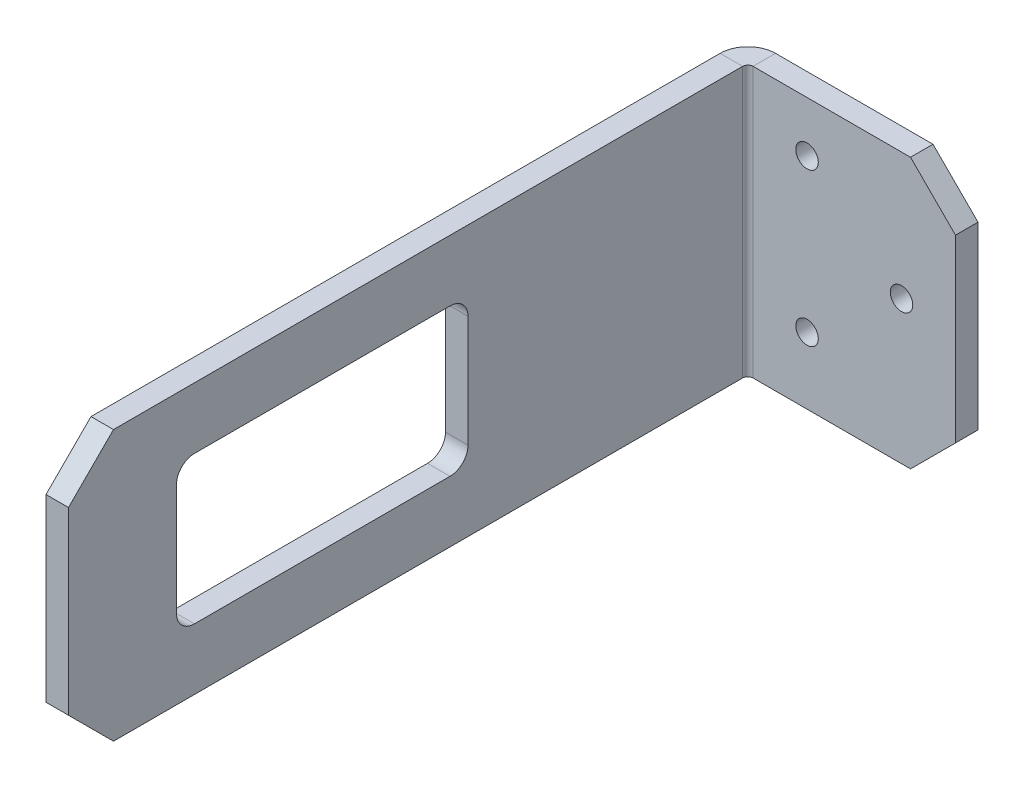
ISO-10303-21;
HEADER;
FILE_DESCRIPTION(('STEP AP214'),'2;1');
FILE_NAME('part.step','',(''),(''),'','','');
FILE_SCHEMA(('AUTOMOTIVE_DESIGN { 1 0 10303 214 1 1 1 1 }'));
ENDSEC;
DATA;
#1=APPLICATION_CONTEXT('core data for automotive mechanical design processes');
#2=APPLICATION_PROTOCOL_DEFINITION('international standard','automotive_design',2000,#1);
#3=PRODUCT_CONTEXT('',#1,'mechanical');
#4=PRODUCT('Part','Part','',(#3));
#5=PRODUCT_RELATED_PRODUCT_CATEGORY('part','',(#4));
#6=PRODUCT_DEFINITION_FORMATION('','',#4);
#7=PRODUCT_DEFINITION_CONTEXT('part definition',#1,'design');
#8=PRODUCT_DEFINITION('design','',#6,#7);
#9=PRODUCT_DEFINITION_SHAPE('','',#8);
#10=(LENGTH_UNIT() NAMED_UNIT(*) SI_UNIT(.MILLI.,.METRE.));
#11=(NAMED_UNIT(*) PLANE_ANGLE_UNIT() SI_UNIT($,.RADIAN.));
#12=(NAMED_UNIT(*) SI_UNIT($,.STERADIAN.) SOLID_ANGLE_UNIT());
#13=UNCERTAINTY_MEASURE_WITH_UNIT(LENGTH_MEASURE(1.E-05),#10,'distance_accuracy_value','');
#14=(GEOMETRIC_REPRESENTATION_CONTEXT(3) GLOBAL_UNCERTAINTY_ASSIGNED_CONTEXT((#13)) GLOBAL_UNIT_ASSIGNED_CONTEXT((#10,
#11,#12)) REPRESENTATION_CONTEXT('',''));
#15=CARTESIAN_POINT('',(0.,0.,0.));
#16=DIRECTION('',(0.,0.,1.));
#17=DIRECTION('',(1.,0.,0.));
#18=AXIS2_PLACEMENT_3D('',#15,#16,#17);
#19=CARTESIAN_POINT('',(0.,38.1,-3.175));
#20=DIRECTION('',(0.,1.,0.));
#21=DIRECTION('',(0.,0.,1.));
#22=AXIS2_PLACEMENT_3D('',#19,#20,#21);
#23=PLANE('',#22);
#24=DIRECTION('',(-1.,0.,0.));
#25=VECTOR('',#24,1.);
#26=CARTESIAN_POINT('',(0.,38.1,0.));
#27=LINE('',#26,#25);
#28=CARTESIAN_POINT('',(22.225,38.1,0.));
#29=VERTEX_POINT('',#28);
#30=CARTESIAN_POINT('',(0.,38.1,0.));
#31=VERTEX_POINT('',#30);
#32=EDGE_CURVE('E293',#29,#31,#27,.T.);
#33=ORIENTED_EDGE('',*,*,#32,.F.);
#34=DIRECTION('',(0.,0.,-1.));
#35=VECTOR('',#34,1.);
#36=CARTESIAN_POINT('',(22.225,38.1,-3.175));
#37=LINE('',#36,#35);
#38=CARTESIAN_POINT('',(22.225,38.1,-3.175));
#39=VERTEX_POINT('',#38);
#40=EDGE_CURVE('E319',#29,#39,#37,.T.);
#41=ORIENTED_EDGE('',*,*,#40,.T.);
#42=DIRECTION('',(-1.,0.,0.));
#43=VECTOR('',#42,1.);
#44=CARTESIAN_POINT('',(0.,38.1,-3.175));
#45=LINE('',#44,#43);
#46=CARTESIAN_POINT('',(0.,38.1,-3.175));
#47=VERTEX_POINT('',#46);
#48=EDGE_CURVE('E298',#39,#47,#45,.T.);
#49=ORIENTED_EDGE('',*,*,#48,.T.);
#50=DIRECTION('',(0.,0.,1.));
#51=VECTOR('',#50,1.);
#52=CARTESIAN_POINT('',(0.,38.1,-3.175));
#53=LINE('',#52,#51);
#54=EDGE_CURVE('E309',#47,#31,#53,.T.);
#55=ORIENTED_EDGE('',*,*,#54,.T.);
#56=EDGE_LOOP('',(#33,#41,#49,#55));
#57=FACE_BOUND('',#56,.T.);
#58=ADVANCED_FACE('F59',(#57),#23,.T.);
#59=CARTESIAN_POINT('',(28.575,0.,-3.175));
#60=DIRECTION('',(1.,0.,0.));
#61=DIRECTION('',(0.,0.,-1.));
#62=AXIS2_PLACEMENT_3D('',#59,#60,#61);
#63=PLANE('',#62);
#64=DIRECTION('',(0.,1.,0.));
#65=VECTOR('',#64,1.);
#66=CARTESIAN_POINT('',(28.575,0.,0.));
#67=LINE('',#66,#65);
#68=CARTESIAN_POINT('',(28.575,6.35000000000004,0.));
#69=VERTEX_POINT('',#68);
#70=CARTESIAN_POINT('',(28.575,31.7499999999999,0.));
#71=VERTEX_POINT('',#70);
#72=EDGE_CURVE('E306',#69,#71,#67,.T.);
#73=ORIENTED_EDGE('',*,*,#72,.F.);
#74=DIRECTION('',(0.,0.,-1.));
#75=VECTOR('',#74,1.);
#76=CARTESIAN_POINT('',(28.575,6.35000000000004,-3.175));
#77=LINE('',#76,#75);
#78=CARTESIAN_POINT('',(28.575,6.35000000000004,-3.175));
#79=VERTEX_POINT('',#78);
#80=EDGE_CURVE('E329',#69,#79,#77,.T.);
#81=ORIENTED_EDGE('',*,*,#80,.T.);
#82=DIRECTION('',(0.,1.,0.));
#83=VECTOR('',#82,1.);
#84=CARTESIAN_POINT('',(28.575,0.,-3.175));
#85=LINE('',#84,#83);
#86=CARTESIAN_POINT('',(28.575,31.7499999999999,-3.175));
#87=VERTEX_POINT('',#86);
#88=EDGE_CURVE('E296',#79,#87,#85,.T.);
#89=ORIENTED_EDGE('',*,*,#88,.T.);
#90=DIRECTION('',(0.,0.,1.));
#91=VECTOR('',#90,1.);
#92=CARTESIAN_POINT('',(28.575,31.75,-3.175));
#93=LINE('',#92,#91);
#94=EDGE_CURVE('E312',#87,#71,#93,.T.);
#95=ORIENTED_EDGE('',*,*,#94,.T.);
#96=EDGE_LOOP('',(#73,#81,#89,#95));
#97=FACE_BOUND('',#96,.T.);
#98=ADVANCED_FACE('F413',(#97),#63,.T.);
#99=CARTESIAN_POINT('',(0.,0.,-3.175));
#100=DIRECTION('',(0.,-1.,0.));
#101=DIRECTION('',(0.,0.,-1.));
#102=AXIS2_PLACEMENT_3D('',#99,#100,#101);
#103=PLANE('',#102);
#104=DIRECTION('',(1.,0.,0.));
#105=VECTOR('',#104,1.);
#106=CARTESIAN_POINT('',(0.,0.,-3.175));
#107=LINE('',#106,#105);
#108=CARTESIAN_POINT('',(0.,0.,-3.175));
#109=VERTEX_POINT('',#108);
#110=CARTESIAN_POINT('',(22.225,0.,-3.175));
#111=VERTEX_POINT('',#110);
#112=EDGE_CURVE('E292',#109,#111,#107,.T.);
#113=ORIENTED_EDGE('',*,*,#112,.T.);
#114=DIRECTION('',(0.,0.,1.));
#115=VECTOR('',#114,1.);
#116=CARTESIAN_POINT('',(22.225,0.,-3.175));
#117=LINE('',#116,#115);
#118=CARTESIAN_POINT('',(22.225,0.,0.));
#119=VERTEX_POINT('',#118);
#120=EDGE_CURVE('E324',#111,#119,#117,.T.);
#121=ORIENTED_EDGE('',*,*,#120,.T.);
#122=DIRECTION('',(1.,0.,0.));
#123=VECTOR('',#122,1.);
#124=CARTESIAN_POINT('',(0.,0.,0.));
#125=LINE('',#124,#123);
#126=CARTESIAN_POINT('',(0.,0.,0.));
#127=VERTEX_POINT('',#126);
#128=EDGE_CURVE('E303',#127,#119,#125,.T.);
#129=ORIENTED_EDGE('',*,*,#128,.F.);
#130=DIRECTION('',(0.,0.,1.));
#131=VECTOR('',#130,1.);
#132=CARTESIAN_POINT('',(0.,0.,-3.175));
#133=LINE('',#132,#131);
#134=EDGE_CURVE('E300',#109,#127,#133,.T.);
#135=ORIENTED_EDGE('',*,*,#134,.F.);
#136=EDGE_LOOP('',(#113,#121,#129,#135));
#137=FACE_BOUND('',#136,.T.);
#138=ADVANCED_FACE('F391',(#137),#103,.T.);
#139=CARTESIAN_POINT('',(0.,0.,-3.175));
#140=DIRECTION('',(0.,0.,-1.));
#141=DIRECTION('',(-1.,0.,0.));
#142=AXIS2_PLACEMENT_3D('',#139,#140,#141);
#143=PLANE('',#142);
#144=CARTESIAN_POINT('',(7.62,30.962643990037,-3.175));
#145=DIRECTION('',(0.,0.,-1.));
#146=DIRECTION('',(-1.,0.,0.));
#147=AXIS2_PLACEMENT_3D('',#144,#145,#146);
#148=CIRCLE('',#147,1.5875);
#149=CARTESIAN_POINT('',(6.0325,30.962643990037,-3.175));
#150=VERTEX_POINT('',#149);
#151=EDGE_CURVE('E778',#150,#150,#148,.F.);
#152=ORIENTED_EDGE('',*,*,#151,.T.);
#153=EDGE_LOOP('',(#152));
#154=FACE_BOUND('',#153,.T.);
#155=CARTESIAN_POINT('',(20.955,20.1838638437053,-3.175));
#156=DIRECTION('',(0.,0.,-1.));
#157=DIRECTION('',(-1.,0.,0.));
#158=AXIS2_PLACEMENT_3D('',#155,#156,#157);
#159=CIRCLE('',#158,1.5875);
#160=CARTESIAN_POINT('',(19.3675,20.1838638437053,-3.175));
#161=VERTEX_POINT('',#160);
#162=EDGE_CURVE('E491',#161,#161,#159,.F.);
#163=ORIENTED_EDGE('',*,*,#162,.T.);
#164=EDGE_LOOP('',(#163));
#165=FACE_BOUND('',#164,.T.);
#166=CARTESIAN_POINT('',(7.62,9.40508369737358,-3.175));
#167=DIRECTION('',(0.,0.,-1.));
#168=DIRECTION('',(-1.,0.,0.));
#169=AXIS2_PLACEMENT_3D('',#166,#167,#168);
#170=CIRCLE('',#169,1.5875);
#171=CARTESIAN_POINT('',(6.0325,9.40508369737358,-3.175));
#172=VERTEX_POINT('',#171);
#173=EDGE_CURVE('E492',#172,#172,#170,.F.);
#174=ORIENTED_EDGE('',*,*,#173,.T.);
#175=EDGE_LOOP('',(#174));
#176=FACE_BOUND('',#175,.T.);
#177=ORIENTED_EDGE('',*,*,#88,.F.);
#178=DIRECTION('',(0.707106781186548,0.707106781186547,0.));
#179=VECTOR('',#178,1.);
#180=CARTESIAN_POINT('',(11.1125,-11.1125,-3.175));
#181=LINE('',#180,#179);
#182=EDGE_CURVE('E331',#79,#111,#181,.F.);
#183=ORIENTED_EDGE('',*,*,#182,.T.);
#184=ORIENTED_EDGE('',*,*,#112,.F.);
#185=DIRECTION('',(0.,-1.,0.));
#186=VECTOR('',#185,1.);
#187=CARTESIAN_POINT('',(0.,0.,-3.175));
#188=LINE('',#187,#186);
#189=EDGE_CURVE('E289',#47,#109,#188,.T.);
#190=ORIENTED_EDGE('',*,*,#189,.F.);
#191=ORIENTED_EDGE('',*,*,#48,.F.);
#192=DIRECTION('',(-0.707106781186548,0.707106781186547,0.));
#193=VECTOR('',#192,1.);
#194=CARTESIAN_POINT('',(30.1625,30.1625,-3.175));
#195=LINE('',#194,#193);
#196=EDGE_CURVE('E321',#39,#87,#195,.F.);
#197=ORIENTED_EDGE('',*,*,#196,.T.);
#198=EDGE_LOOP('',(#177,#183,#184,#190,#191,#197));
#199=FACE_BOUND('',#198,.T.);
#200=ADVANCED_FACE('F399',(#154,#165,#176,#199),#143,.T.);
#201=CARTESIAN_POINT('',(0.,0.,0.));
#202=DIRECTION('',(0.,0.,-1.));
#203=DIRECTION('',(-1.,0.,0.));
#204=AXIS2_PLACEMENT_3D('',#201,#202,#203);
#205=PLANE('',#204);
#206=CARTESIAN_POINT('',(7.62,30.962643990037,0.));
#207=DIRECTION('',(0.,0.,1.));
#208=DIRECTION('',(1.,0.,0.));
#209=AXIS2_PLACEMENT_3D('',#206,#207,#208);
#210=CIRCLE('',#209,1.5875);
#211=CARTESIAN_POINT('',(9.2075,30.962643990037,0.));
#212=VERTEX_POINT('',#211);
#213=EDGE_CURVE('E482',#212,#212,#210,.T.);
#214=ORIENTED_EDGE('',*,*,#213,.F.);
#215=EDGE_LOOP('',(#214));
#216=FACE_BOUND('',#215,.T.);
#217=CARTESIAN_POINT('',(20.955,20.1838638437053,0.));
#218=DIRECTION('',(0.,0.,1.));
#219=DIRECTION('',(1.,0.,0.));
#220=AXIS2_PLACEMENT_3D('',#217,#218,#219);
#221=CIRCLE('',#220,1.5875);
#222=CARTESIAN_POINT('',(22.5425,20.1838638437053,0.));
#223=VERTEX_POINT('',#222);
#224=EDGE_CURVE('E486',#223,#223,#221,.T.);
#225=ORIENTED_EDGE('',*,*,#224,.F.);
#226=EDGE_LOOP('',(#225));
#227=FACE_BOUND('',#226,.T.);
#228=CARTESIAN_POINT('',(7.62,9.40508369737358,0.));
#229=DIRECTION('',(0.,0.,1.));
#230=DIRECTION('',(1.,0.,0.));
#231=AXIS2_PLACEMENT_3D('',#228,#229,#230);
#232=CIRCLE('',#231,1.5875);
#233=CARTESIAN_POINT('',(9.2075,9.40508369737358,0.));
#234=VERTEX_POINT('',#233);
#235=EDGE_CURVE('E489',#234,#234,#232,.T.);
#236=ORIENTED_EDGE('',*,*,#235,.F.);
#237=EDGE_LOOP('',(#236));
#238=FACE_BOUND('',#237,.T.);
#239=ORIENTED_EDGE('',*,*,#128,.T.);
#240=DIRECTION('',(-0.707106781186548,-0.707106781186547,0.));
#241=VECTOR('',#240,1.);
#242=CARTESIAN_POINT('',(22.225,0.,0.));
#243=LINE('',#242,#241);
#244=EDGE_CURVE('E327',#119,#69,#243,.F.);
#245=ORIENTED_EDGE('',*,*,#244,.T.);
#246=ORIENTED_EDGE('',*,*,#72,.T.);
#247=DIRECTION('',(0.707106781186548,-0.707106781186547,0.));
#248=VECTOR('',#247,1.);
#249=CARTESIAN_POINT('',(28.575,31.75,0.));
#250=LINE('',#249,#248);
#251=EDGE_CURVE('E317',#71,#29,#250,.F.);
#252=ORIENTED_EDGE('',*,*,#251,.T.);
#253=ORIENTED_EDGE('',*,*,#32,.T.);
#254=DIRECTION('',(0.,-1.,0.));
#255=VECTOR('',#254,1.);
#256=CARTESIAN_POINT('',(0.,0.,0.));
#257=LINE('',#256,#255);
#258=EDGE_CURVE('E280',#31,#127,#257,.T.);
#259=ORIENTED_EDGE('',*,*,#258,.T.);
#260=EDGE_LOOP('',(#239,#245,#246,#252,#253,#259));
#261=FACE_BOUND('',#260,.T.);
#262=ADVANCED_FACE('F385',(#216,#227,#238,#261),#205,.F.);
#263=CARTESIAN_POINT('',(0.,38.1,0.7366));
#264=DIRECTION('',(0.,1.,0.));
#265=DIRECTION('',(-1.,0.,0.));
#266=AXIS2_PLACEMENT_3D('',#263,#264,#265);
#267=PLANE('',#266);
#268=DIRECTION('',(1.,0.,0.));
#269=VECTOR('',#268,1.);
#270=CARTESIAN_POINT('',(-3.9116,38.1,0.736599999999986));
#271=LINE('',#270,#269);
#272=CARTESIAN_POINT('',(-0.7366,38.1,0.736599999999997));
#273=VERTEX_POINT('',#272);
#274=CARTESIAN_POINT('',(-3.9116,38.1,0.736599999999986));
#275=VERTEX_POINT('',#274);
#276=EDGE_CURVE('E202',#273,#275,#271,.F.);
#277=ORIENTED_EDGE('',*,*,#276,.F.);
#278=CARTESIAN_POINT('',(0.,38.1,0.7366));
#279=DIRECTION('',(0.,-1.,0.));
#280=DIRECTION('',(1.,0.,0.));
#281=AXIS2_PLACEMENT_3D('',#278,#279,#280);
#282=CIRCLE('',#281,0.736600000000001);
#283=EDGE_CURVE('E284',#31,#273,#282,.F.);
#284=ORIENTED_EDGE('',*,*,#283,.F.);
#285=ORIENTED_EDGE('',*,*,#54,.F.);
#286=CARTESIAN_POINT('',(0.,38.1,0.7366));
#287=DIRECTION('',(0.,-1.,0.));
#288=DIRECTION('',(1.,0.,0.));
#289=AXIS2_PLACEMENT_3D('',#286,#287,#288);
#290=CIRCLE('',#289,3.9116);
#291=EDGE_CURVE('E277',#47,#275,#290,.F.);
#292=ORIENTED_EDGE('',*,*,#291,.T.);
#293=EDGE_LOOP('',(#277,#284,#285,#292));
#294=FACE_BOUND('',#293,.T.);
#295=ADVANCED_FACE('F377',(#294),#267,.T.);
#296=CARTESIAN_POINT('',(0.,0.,0.7366));
#297=DIRECTION('',(0.,1.,0.));
#298=DIRECTION('',(-1.,0.,0.));
#299=AXIS2_PLACEMENT_3D('',#296,#297,#298);
#300=PLANE('',#299);
#301=CARTESIAN_POINT('',(0.,0.,0.7366));
#302=DIRECTION('',(0.,-1.,0.));
#303=DIRECTION('',(1.,0.,0.));
#304=AXIS2_PLACEMENT_3D('',#301,#302,#303);
#305=CIRCLE('',#304,0.736600000000001);
#306=CARTESIAN_POINT('',(-0.736600000000003,0.,0.736599999999997));
#307=VERTEX_POINT('',#306);
#308=EDGE_CURVE('E254',#307,#127,#305,.T.);
#309=ORIENTED_EDGE('',*,*,#308,.F.);
#310=DIRECTION('',(1.,0.,0.));
#311=VECTOR('',#310,1.);
#312=CARTESIAN_POINT('',(-0.7366,0.,0.736599999999997));
#313=LINE('',#312,#311);
#314=CARTESIAN_POINT('',(-3.9116,0.,0.736599999999986));
#315=VERTEX_POINT('',#314);
#316=EDGE_CURVE('E270',#307,#315,#313,.F.);
#317=ORIENTED_EDGE('',*,*,#316,.T.);
#318=CARTESIAN_POINT('',(0.,0.,0.7366));
#319=DIRECTION('',(0.,-1.,0.));
#320=DIRECTION('',(1.,0.,0.));
#321=AXIS2_PLACEMENT_3D('',#318,#319,#320);
#322=CIRCLE('',#321,3.9116);
#323=EDGE_CURVE('E281',#315,#109,#322,.T.);
#324=ORIENTED_EDGE('',*,*,#323,.T.);
#325=ORIENTED_EDGE('',*,*,#134,.T.);
#326=EDGE_LOOP('',(#309,#317,#324,#325));
#327=FACE_BOUND('',#326,.T.);
#328=ADVANCED_FACE('F389',(#327),#300,.F.);
#329=CARTESIAN_POINT('',(0.,0.,0.7366));
#330=DIRECTION('',(0.,-1.,0.));
#331=DIRECTION('',(-1.,0.,0.));
#332=AXIS2_PLACEMENT_3D('',#329,#330,#331);
#333=CYLINDRICAL_SURFACE('',#332,3.9116);
#334=ORIENTED_EDGE('',*,*,#189,.T.);
#335=ORIENTED_EDGE('',*,*,#323,.F.);
#336=DIRECTION('',(0.,-1.,0.));
#337=VECTOR('',#336,1.);
#338=CARTESIAN_POINT('',(-3.9116,38.1,0.736599999999986));
#339=LINE('',#338,#337);
#340=EDGE_CURVE('E267',#315,#275,#339,.F.);
#341=ORIENTED_EDGE('',*,*,#340,.T.);
#342=ORIENTED_EDGE('',*,*,#291,.F.);
#343=EDGE_LOOP('',(#334,#335,#341,#342));
#344=FACE_BOUND('',#343,.T.);
#345=ADVANCED_FACE('F395',(#344),#333,.T.);
#346=CARTESIAN_POINT('',(0.,0.,0.7366));
#347=DIRECTION('',(0.,-1.,0.));
#348=DIRECTION('',(-1.,0.,0.));
#349=AXIS2_PLACEMENT_3D('',#346,#347,#348);
#350=CYLINDRICAL_SURFACE('',#349,0.736600000000001);
#351=ORIENTED_EDGE('',*,*,#258,.F.);
#352=ORIENTED_EDGE('',*,*,#283,.T.);
#353=DIRECTION('',(0.,-1.,0.));
#354=VECTOR('',#353,1.);
#355=CARTESIAN_POINT('',(-0.7366,38.1,0.736599999999997));
#356=LINE('',#355,#354);
#357=EDGE_CURVE('E273',#273,#307,#356,.T.);
#358=ORIENTED_EDGE('',*,*,#357,.T.);
#359=ORIENTED_EDGE('',*,*,#308,.T.);
#360=EDGE_LOOP('',(#351,#352,#358,#359));
#361=FACE_BOUND('',#360,.T.);
#362=ADVANCED_FACE('F382',(#361),#350,.F.);
#363=CARTESIAN_POINT('',(-3.91160000000033,0.,95.885));
#364=DIRECTION('',(0.,1.,0.));
#365=DIRECTION('',(0.,0.,1.));
#366=AXIS2_PLACEMENT_3D('',#363,#364,#365);
#367=PLANE('',#366);
#368=DIRECTION('',(0.,0.,-1.));
#369=VECTOR('',#368,1.);
#370=CARTESIAN_POINT('',(-0.736600000000332,0.,95.885));
#371=LINE('',#370,#369);
#372=CARTESIAN_POINT('',(-0.73660000000031,0.,89.535));
#373=VERTEX_POINT('',#372);
#374=EDGE_CURVE('E264',#307,#373,#371,.F.);
#375=ORIENTED_EDGE('',*,*,#374,.T.);
#376=DIRECTION('',(-1.,0.,0.));
#377=VECTOR('',#376,1.);
#378=CARTESIAN_POINT('',(-3.91160000000031,0.,89.535));
#379=LINE('',#378,#377);
#380=CARTESIAN_POINT('',(-3.91160000000031,0.,89.535));
#381=VERTEX_POINT('',#380);
#382=EDGE_CURVE('E68',#373,#381,#379,.T.);
#383=ORIENTED_EDGE('',*,*,#382,.T.);
#384=DIRECTION('',(0.,0.,1.));
#385=VECTOR('',#384,1.);
#386=CARTESIAN_POINT('',(-3.9116,0.,0.));
#387=LINE('',#386,#385);
#388=EDGE_CURVE('E257',#315,#381,#387,.T.);
#389=ORIENTED_EDGE('',*,*,#388,.F.);
#390=ORIENTED_EDGE('',*,*,#316,.F.);
#391=EDGE_LOOP('',(#375,#383,#389,#390));
#392=FACE_BOUND('',#391,.T.);
#393=ADVANCED_FACE('F351',(#392),#367,.F.);
#394=CARTESIAN_POINT('',(-3.9116,38.1,0.));
#395=DIRECTION('',(0.,-1.,0.));
#396=DIRECTION('',(0.,0.,-1.));
#397=AXIS2_PLACEMENT_3D('',#394,#395,#396);
#398=PLANE('',#397);
#399=DIRECTION('',(0.,0.,-1.));
#400=VECTOR('',#399,1.);
#401=CARTESIAN_POINT('',(-3.9116,38.1,0.));
#402=LINE('',#401,#400);
#403=CARTESIAN_POINT('',(-3.91160000000031,38.1,89.535));
#404=VERTEX_POINT('',#403);
#405=EDGE_CURVE('E252',#404,#275,#402,.T.);
#406=ORIENTED_EDGE('',*,*,#405,.F.);
#407=DIRECTION('',(1.,0.,0.));
#408=VECTOR('',#407,1.);
#409=CARTESIAN_POINT('',(-3.91160000000031,38.1,89.535));
#410=LINE('',#409,#408);
#411=CARTESIAN_POINT('',(-0.73660000000031,38.1,89.535));
#412=VERTEX_POINT('',#411);
#413=EDGE_CURVE('E333',#404,#412,#410,.T.);
#414=ORIENTED_EDGE('',*,*,#413,.T.);
#415=DIRECTION('',(0.,0.,1.));
#416=VECTOR('',#415,1.);
#417=CARTESIAN_POINT('',(-0.736599999999997,38.1,0.));
#418=LINE('',#417,#416);
#419=EDGE_CURVE('E260',#412,#273,#418,.F.);
#420=ORIENTED_EDGE('',*,*,#419,.T.);
#421=ORIENTED_EDGE('',*,*,#276,.T.);
#422=EDGE_LOOP('',(#406,#414,#420,#421));
#423=FACE_BOUND('',#422,.T.);
#424=ADVANCED_FACE('F373',(#423),#398,.F.);
#425=CARTESIAN_POINT('',(-3.9116,0.,0.));
#426=DIRECTION('',(1.,0.,0.));
#427=DIRECTION('',(0.,0.,-1.));
#428=AXIS2_PLACEMENT_3D('',#425,#426,#427);
#429=PLANE('',#428);
#430=DIRECTION('',(0.,0.,1.));
#431=VECTOR('',#430,1.);
#432=CARTESIAN_POINT('',(-3.91160000000014,8.636,42.037));
#433=LINE('',#432,#431);
#434=CARTESIAN_POINT('',(-3.91160000000014,8.636,42.037));
#435=VERTEX_POINT('',#434);
#436=CARTESIAN_POINT('',(-3.91160000000027,8.636,78.105));
#437=VERTEX_POINT('',#436);
#438=EDGE_CURVE('E216',#435,#437,#433,.T.);
#439=ORIENTED_EDGE('',*,*,#438,.F.);
#440=CARTESIAN_POINT('',(-3.91160000000014,11.176,42.037));
#441=DIRECTION('',(-1.,0.,0.));
#442=DIRECTION('',(0.,0.,-1.));
#443=AXIS2_PLACEMENT_3D('',#440,#441,#442);
#444=CIRCLE('',#443,2.54);
#445=CARTESIAN_POINT('',(-3.91160000000014,11.176,39.497));
#446=VERTEX_POINT('',#445);
#447=EDGE_CURVE('E75',#446,#435,#444,.T.);
#448=ORIENTED_EDGE('',*,*,#447,.F.);
#449=DIRECTION('',(0.,-1.,0.));
#450=VECTOR('',#449,1.);
#451=CARTESIAN_POINT('',(-3.91160000000014,11.176,39.497));
#452=LINE('',#451,#450);
#453=CARTESIAN_POINT('',(-3.91160000000014,26.924,39.497));
#454=VERTEX_POINT('',#453);
#455=EDGE_CURVE('E208',#454,#446,#452,.T.);
#456=ORIENTED_EDGE('',*,*,#455,.F.);
#457=CARTESIAN_POINT('',(-3.91160000000014,26.924,42.037));
#458=DIRECTION('',(-1.,0.,0.));
#459=DIRECTION('',(0.,0.,-1.));
#460=AXIS2_PLACEMENT_3D('',#457,#458,#459);
#461=CIRCLE('',#460,2.54);
#462=CARTESIAN_POINT('',(-3.91160000000014,29.464,42.037));
#463=VERTEX_POINT('',#462);
#464=EDGE_CURVE('E235',#463,#454,#461,.T.);
#465=ORIENTED_EDGE('',*,*,#464,.F.);
#466=DIRECTION('',(0.,0.,-1.));
#467=VECTOR('',#466,1.);
#468=CARTESIAN_POINT('',(-3.91160000000014,29.464,42.037));
#469=LINE('',#468,#467);
#470=CARTESIAN_POINT('',(-3.91160000000027,29.464,78.105));
#471=VERTEX_POINT('',#470);
#472=EDGE_CURVE('E232',#471,#463,#469,.T.);
#473=ORIENTED_EDGE('',*,*,#472,.F.);
#474=CARTESIAN_POINT('',(-3.91160000000027,26.924,78.105));
#475=DIRECTION('',(-1.,0.,0.));
#476=DIRECTION('',(0.,0.,-1.));
#477=AXIS2_PLACEMENT_3D('',#474,#475,#476);
#478=CIRCLE('',#477,2.54);
#479=CARTESIAN_POINT('',(-3.91160000000028,26.924,80.645));
#480=VERTEX_POINT('',#479);
#481=EDGE_CURVE('E229',#480,#471,#478,.T.);
#482=ORIENTED_EDGE('',*,*,#481,.F.);
#483=DIRECTION('',(0.,1.,0.));
#484=VECTOR('',#483,1.);
#485=CARTESIAN_POINT('',(-3.91160000000028,11.176,80.645));
#486=LINE('',#485,#484);
#487=CARTESIAN_POINT('',(-3.91160000000028,11.176,80.645));
#488=VERTEX_POINT('',#487);
#489=EDGE_CURVE('E226',#488,#480,#486,.T.);
#490=ORIENTED_EDGE('',*,*,#489,.F.);
#491=CARTESIAN_POINT('',(-3.91160000000027,11.176,78.105));
#492=DIRECTION('',(-1.,0.,0.));
#493=DIRECTION('',(0.,0.,1.));
#494=AXIS2_PLACEMENT_3D('',#491,#492,#493);
#495=CIRCLE('',#494,2.54);
#496=EDGE_CURVE('E223',#437,#488,#495,.T.);
#497=ORIENTED_EDGE('',*,*,#496,.F.);
#498=EDGE_LOOP('',(#439,#448,#456,#465,#473,#482,#490,#497));
#499=FACE_BOUND('',#498,.T.);
#500=ORIENTED_EDGE('',*,*,#388,.T.);
#501=DIRECTION('',(0.,-0.707106781186547,-0.707106781186548));
#502=VECTOR('',#501,1.);
#503=CARTESIAN_POINT('',(-3.91160000000033,6.35000000000004,95.885));
#504=LINE('',#503,#502);
#505=CARTESIAN_POINT('',(-3.91160000000033,6.35000000000004,95.885));
#506=VERTEX_POINT('',#505);
#507=EDGE_CURVE('E13',#381,#506,#504,.F.);
#508=ORIENTED_EDGE('',*,*,#507,.T.);
#509=DIRECTION('',(0.,1.,0.));
#510=VECTOR('',#509,1.);
#511=CARTESIAN_POINT('',(-3.91160000000033,0.,95.885));
#512=LINE('',#511,#510);
#513=CARTESIAN_POINT('',(-3.91160000000033,31.7499999999999,95.885));
#514=VERTEX_POINT('',#513);
#515=EDGE_CURVE('E255',#506,#514,#512,.T.);
#516=ORIENTED_EDGE('',*,*,#515,.T.);
#517=DIRECTION('',(0.,-0.707106781186547,0.707106781186548));
#518=VECTOR('',#517,1.);
#519=CARTESIAN_POINT('',(-3.91160000000031,38.1,89.535));
#520=LINE('',#519,#518);
#521=EDGE_CURVE('E342',#514,#404,#520,.F.);
#522=ORIENTED_EDGE('',*,*,#521,.T.);
#523=ORIENTED_EDGE('',*,*,#405,.T.);
#524=ORIENTED_EDGE('',*,*,#340,.F.);
#525=EDGE_LOOP('',(#500,#508,#516,#522,#523,#524));
#526=FACE_BOUND('',#525,.T.);
#527=ADVANCED_FACE('F358',(#499,#526),#429,.F.);
#528=CARTESIAN_POINT('',(-0.736599999999997,0.,0.));
#529=DIRECTION('',(1.,0.,0.));
#530=DIRECTION('',(0.,0.,-1.));
#531=AXIS2_PLACEMENT_3D('',#528,#529,#530);
#532=PLANE('',#531);
#533=CARTESIAN_POINT('',(-0.736600000000143,11.176,42.037));
#534=DIRECTION('',(1.,0.,0.));
#535=DIRECTION('',(0.,0.,-1.));
#536=AXIS2_PLACEMENT_3D('',#533,#534,#535);
#537=CIRCLE('',#536,2.54);
#538=CARTESIAN_POINT('',(-0.736600000000136,11.176,39.497));
#539=VERTEX_POINT('',#538);
#540=CARTESIAN_POINT('',(-0.736600000000143,8.636,42.037));
#541=VERTEX_POINT('',#540);
#542=EDGE_CURVE('E206',#539,#541,#537,.F.);
#543=ORIENTED_EDGE('',*,*,#542,.T.);
#544=DIRECTION('',(0.,0.,1.));
#545=VECTOR('',#544,1.);
#546=CARTESIAN_POINT('',(-0.736600000000143,8.636,42.037));
#547=LINE('',#546,#545);
#548=CARTESIAN_POINT('',(-0.73660000000027,8.636,78.105));
#549=VERTEX_POINT('',#548);
#550=EDGE_CURVE('E195',#541,#549,#547,.T.);
#551=ORIENTED_EDGE('',*,*,#550,.T.);
#552=CARTESIAN_POINT('',(-0.736600000000271,11.176,78.105));
#553=DIRECTION('',(1.,0.,0.));
#554=DIRECTION('',(0.,0.,-1.));
#555=AXIS2_PLACEMENT_3D('',#552,#553,#554);
#556=CIRCLE('',#555,2.54);
#557=CARTESIAN_POINT('',(-0.73660000000028,11.176,80.645));
#558=VERTEX_POINT('',#557);
#559=EDGE_CURVE('E500',#549,#558,#556,.F.);
#560=ORIENTED_EDGE('',*,*,#559,.T.);
#561=DIRECTION('',(0.,1.,0.));
#562=VECTOR('',#561,1.);
#563=CARTESIAN_POINT('',(-0.736600000000278,11.176,80.645));
#564=LINE('',#563,#562);
#565=CARTESIAN_POINT('',(-0.736600000000278,26.924,80.645));
#566=VERTEX_POINT('',#565);
#567=EDGE_CURVE('E502',#558,#566,#564,.T.);
#568=ORIENTED_EDGE('',*,*,#567,.T.);
#569=CARTESIAN_POINT('',(-0.736600000000271,26.924,78.105));
#570=DIRECTION('',(1.,0.,0.));
#571=DIRECTION('',(0.,0.,-1.));
#572=AXIS2_PLACEMENT_3D('',#569,#570,#571);
#573=CIRCLE('',#572,2.54);
#574=CARTESIAN_POINT('',(-0.736600000000271,29.464,78.105));
#575=VERTEX_POINT('',#574);
#576=EDGE_CURVE('E505',#566,#575,#573,.F.);
#577=ORIENTED_EDGE('',*,*,#576,.T.);
#578=DIRECTION('',(0.,0.,-1.));
#579=VECTOR('',#578,1.);
#580=CARTESIAN_POINT('',(-0.736600000000143,29.464,42.037));
#581=LINE('',#580,#579);
#582=CARTESIAN_POINT('',(-0.736600000000143,29.464,42.037));
#583=VERTEX_POINT('',#582);
#584=EDGE_CURVE('E508',#575,#583,#581,.T.);
#585=ORIENTED_EDGE('',*,*,#584,.T.);
#586=CARTESIAN_POINT('',(-0.736600000000143,26.924,42.037));
#587=DIRECTION('',(1.,0.,0.));
#588=DIRECTION('',(0.,0.,-1.));
#589=AXIS2_PLACEMENT_3D('',#586,#587,#588);
#590=CIRCLE('',#589,2.54);
#591=CARTESIAN_POINT('',(-0.736600000000134,26.924,39.497));
#592=VERTEX_POINT('',#591);
#593=EDGE_CURVE('E218',#583,#592,#590,.F.);
#594=ORIENTED_EDGE('',*,*,#593,.T.);
#595=DIRECTION('',(0.,-1.,0.));
#596=VECTOR('',#595,1.);
#597=CARTESIAN_POINT('',(-0.736600000000136,11.176,39.497));
#598=LINE('',#597,#596);
#599=EDGE_CURVE('E214',#592,#539,#598,.T.);
#600=ORIENTED_EDGE('',*,*,#599,.T.);
#601=EDGE_LOOP('',(#543,#551,#560,#568,#577,#585,#594,#600));
#602=FACE_BOUND('',#601,.T.);
#603=DIRECTION('',(0.,-1.,0.));
#604=VECTOR('',#603,1.);
#605=CARTESIAN_POINT('',(-0.736600000000332,38.1,95.885));
#606=LINE('',#605,#604);
#607=CARTESIAN_POINT('',(-0.736600000000332,6.35000000000004,95.885));
#608=VERTEX_POINT('',#607);
#609=CARTESIAN_POINT('',(-0.736600000000332,31.7499999999999,95.885));
#610=VERTEX_POINT('',#609);
#611=EDGE_CURVE('E262',#608,#610,#606,.F.);
#612=ORIENTED_EDGE('',*,*,#611,.F.);
#613=DIRECTION('',(0.,0.707106781186547,0.707106781186548));
#614=VECTOR('',#613,1.);
#615=CARTESIAN_POINT('',(-0.736600000000154,-44.7675,44.7674999999999));
#616=LINE('',#615,#614);
#617=EDGE_CURVE('E347',#608,#373,#616,.F.);
#618=ORIENTED_EDGE('',*,*,#617,.T.);
#619=ORIENTED_EDGE('',*,*,#374,.F.);
#620=ORIENTED_EDGE('',*,*,#357,.F.);
#621=ORIENTED_EDGE('',*,*,#419,.F.);
#622=DIRECTION('',(0.,0.707106781186547,-0.707106781186548));
#623=VECTOR('',#622,1.);
#624=CARTESIAN_POINT('',(-0.73660000000022,63.8175,63.8174999999999));
#625=LINE('',#624,#623);
#626=EDGE_CURVE('E336',#412,#610,#625,.F.);
#627=ORIENTED_EDGE('',*,*,#626,.T.);
#628=EDGE_LOOP('',(#612,#618,#619,#620,#621,#627));
#629=FACE_BOUND('',#628,.T.);
#630=ADVANCED_FACE('F211',(#602,#629),#532,.T.);
#631=CARTESIAN_POINT('',(-3.91160000000033,38.1,95.885));
#632=DIRECTION('',(0.,0.,-1.));
#633=DIRECTION('',(-1.,0.,0.));
#634=AXIS2_PLACEMENT_3D('',#631,#632,#633);
#635=PLANE('',#634);
#636=ORIENTED_EDGE('',*,*,#515,.F.);
#637=DIRECTION('',(1.,0.,0.));
#638=VECTOR('',#637,1.);
#639=CARTESIAN_POINT('',(-3.91160000000033,6.35000000000004,95.885));
#640=LINE('',#639,#638);
#641=EDGE_CURVE('E344',#506,#608,#640,.T.);
#642=ORIENTED_EDGE('',*,*,#641,.T.);
#643=ORIENTED_EDGE('',*,*,#611,.T.);
#644=DIRECTION('',(-1.,0.,0.));
#645=VECTOR('',#644,1.);
#646=CARTESIAN_POINT('',(-3.91160000000033,31.7499999999999,95.885));
#647=LINE('',#646,#645);
#648=EDGE_CURVE('E339',#610,#514,#647,.T.);
#649=ORIENTED_EDGE('',*,*,#648,.T.);
#650=EDGE_LOOP('',(#636,#642,#643,#649));
#651=FACE_BOUND('',#650,.T.);
#652=ADVANCED_FACE('F363',(#651),#635,.F.);
#653=CARTESIAN_POINT('',(28.575,31.75,-3.175));
#654=DIRECTION('',(-0.707106781186547,-0.707106781186548,0.));
#655=DIRECTION('',(0.,0.,1.));
#656=AXIS2_PLACEMENT_3D('',#653,#654,#655);
#657=PLANE('',#656);
#658=ORIENTED_EDGE('',*,*,#196,.F.);
#659=ORIENTED_EDGE('',*,*,#40,.F.);
#660=ORIENTED_EDGE('',*,*,#251,.F.);
#661=ORIENTED_EDGE('',*,*,#94,.F.);
#662=EDGE_LOOP('',(#658,#659,#660,#661));
#663=FACE_BOUND('',#662,.T.);
#664=ADVANCED_FACE('F405',(#663),#657,.F.);
#665=CARTESIAN_POINT('',(22.225,0.,-3.175));
#666=DIRECTION('',(-0.707106781186547,0.707106781186548,0.));
#667=DIRECTION('',(0.,0.,1.));
#668=AXIS2_PLACEMENT_3D('',#665,#666,#667);
#669=PLANE('',#668);
#670=ORIENTED_EDGE('',*,*,#182,.F.);
#671=ORIENTED_EDGE('',*,*,#80,.F.);
#672=ORIENTED_EDGE('',*,*,#244,.F.);
#673=ORIENTED_EDGE('',*,*,#120,.F.);
#674=EDGE_LOOP('',(#670,#671,#672,#673));
#675=FACE_BOUND('',#674,.T.);
#676=ADVANCED_FACE('F411',(#675),#669,.F.);
#677=CARTESIAN_POINT('',(-3.91160000000031,38.1,89.535));
#678=DIRECTION('',(0.,-0.707106781186548,-0.707106781186547));
#679=DIRECTION('',(1.,0.,0.));
#680=AXIS2_PLACEMENT_3D('',#677,#678,#679);
#681=PLANE('',#680);
#682=ORIENTED_EDGE('',*,*,#521,.F.);
#683=ORIENTED_EDGE('',*,*,#648,.F.);
#684=ORIENTED_EDGE('',*,*,#626,.F.);
#685=ORIENTED_EDGE('',*,*,#413,.F.);
#686=EDGE_LOOP('',(#682,#683,#684,#685));
#687=FACE_BOUND('',#686,.T.);
#688=ADVANCED_FACE('F370',(#687),#681,.F.);
#689=CARTESIAN_POINT('',(-3.91160000000033,6.35000000000004,95.885));
#690=DIRECTION('',(0.,0.707106781186548,-0.707106781186547));
#691=DIRECTION('',(1.,0.,0.));
#692=AXIS2_PLACEMENT_3D('',#689,#690,#691);
#693=PLANE('',#692);
#694=ORIENTED_EDGE('',*,*,#507,.F.);
#695=ORIENTED_EDGE('',*,*,#382,.F.);
#696=ORIENTED_EDGE('',*,*,#617,.F.);
#697=ORIENTED_EDGE('',*,*,#641,.F.);
#698=EDGE_LOOP('',(#694,#695,#696,#697));
#699=FACE_BOUND('',#698,.T.);
#700=ADVANCED_FACE('F62',(#699),#693,.F.);
#701=CARTESIAN_POINT('',(28.5760000000002,11.176,42.0370000000001));
#702=DIRECTION('',(-1.,0.,0.));
#703=DIRECTION('',(0.,0.,1.));
#704=AXIS2_PLACEMENT_3D('',#701,#702,#703);
#705=CYLINDRICAL_SURFACE('',#704,2.54);
#706=DIRECTION('',(-1.,0.,0.));
#707=VECTOR('',#706,1.);
#708=CARTESIAN_POINT('',(28.5760000000002,11.176,39.4970000000001));
#709=LINE('',#708,#707);
#710=EDGE_CURVE('E203',#539,#446,#709,.T.);
#711=ORIENTED_EDGE('',*,*,#710,.T.);
#712=ORIENTED_EDGE('',*,*,#447,.T.);
#713=DIRECTION('',(-1.,0.,0.));
#714=VECTOR('',#713,1.);
#715=CARTESIAN_POINT('',(28.5760000000002,8.636,42.0370000000001));
#716=LINE('',#715,#714);
#717=EDGE_CURVE('E197',#541,#435,#716,.T.);
#718=ORIENTED_EDGE('',*,*,#717,.F.);
#719=ORIENTED_EDGE('',*,*,#542,.F.);
#720=EDGE_LOOP('',(#711,#712,#718,#719));
#721=FACE_BOUND('',#720,.T.);
#722=ADVANCED_FACE('F205',(#721),#705,.F.);
#723=CARTESIAN_POINT('',(28.5760000000002,11.176,39.4970000000001));
#724=DIRECTION('',(0.,0.,-1.));
#725=DIRECTION('',(-1.,0.,0.));
#726=AXIS2_PLACEMENT_3D('',#723,#724,#725);
#727=PLANE('',#726);
#728=DIRECTION('',(-1.,0.,0.));
#729=VECTOR('',#728,1.);
#730=CARTESIAN_POINT('',(28.5760000000002,26.924,39.4970000000001));
#731=LINE('',#730,#729);
#732=EDGE_CURVE('E241',#592,#454,#731,.T.);
#733=ORIENTED_EDGE('',*,*,#732,.T.);
#734=ORIENTED_EDGE('',*,*,#455,.T.);
#735=ORIENTED_EDGE('',*,*,#710,.F.);
#736=ORIENTED_EDGE('',*,*,#599,.F.);
#737=EDGE_LOOP('',(#733,#734,#735,#736));
#738=FACE_BOUND('',#737,.T.);
#739=ADVANCED_FACE('F443',(#738),#727,.F.);
#740=CARTESIAN_POINT('',(28.5760000000002,26.924,42.0370000000001));
#741=DIRECTION('',(-1.,0.,0.));
#742=DIRECTION('',(0.,0.,1.));
#743=AXIS2_PLACEMENT_3D('',#740,#741,#742);
#744=CYLINDRICAL_SURFACE('',#743,2.54);
#745=DIRECTION('',(-1.,0.,0.));
#746=VECTOR('',#745,1.);
#747=CARTESIAN_POINT('',(28.5760000000002,29.464,42.0370000000001));
#748=LINE('',#747,#746);
#749=EDGE_CURVE('E243',#583,#463,#748,.T.);
#750=ORIENTED_EDGE('',*,*,#749,.T.);
#751=ORIENTED_EDGE('',*,*,#464,.T.);
#752=ORIENTED_EDGE('',*,*,#732,.F.);
#753=ORIENTED_EDGE('',*,*,#593,.F.);
#754=EDGE_LOOP('',(#750,#751,#752,#753));
#755=FACE_BOUND('',#754,.T.);
#756=ADVANCED_FACE('F448',(#755),#744,.F.);
#757=CARTESIAN_POINT('',(28.5760000000002,29.464,42.0370000000001));
#758=DIRECTION('',(0.,1.,0.));
#759=DIRECTION('',(0.,0.,1.));
#760=AXIS2_PLACEMENT_3D('',#757,#758,#759);
#761=PLANE('',#760);
#762=DIRECTION('',(-1.,0.,0.));
#763=VECTOR('',#762,1.);
#764=CARTESIAN_POINT('',(28.5760000000001,29.464,78.1050000000001));
#765=LINE('',#764,#763);
#766=EDGE_CURVE('E245',#575,#471,#765,.T.);
#767=ORIENTED_EDGE('',*,*,#766,.T.);
#768=ORIENTED_EDGE('',*,*,#472,.T.);
#769=ORIENTED_EDGE('',*,*,#749,.F.);
#770=ORIENTED_EDGE('',*,*,#584,.F.);
#771=EDGE_LOOP('',(#767,#768,#769,#770));
#772=FACE_BOUND('',#771,.T.);
#773=ADVANCED_FACE('F514',(#772),#761,.F.);
#774=CARTESIAN_POINT('',(28.5760000000001,26.924,78.1050000000001));
#775=DIRECTION('',(-1.,0.,0.));
#776=DIRECTION('',(0.,0.,1.));
#777=AXIS2_PLACEMENT_3D('',#774,#775,#776);
#778=CYLINDRICAL_SURFACE('',#777,2.54);
#779=DIRECTION('',(-1.,0.,0.));
#780=VECTOR('',#779,1.);
#781=CARTESIAN_POINT('',(28.5760000000001,26.924,80.6450000000001));
#782=LINE('',#781,#780);
#783=EDGE_CURVE('E247',#566,#480,#782,.T.);
#784=ORIENTED_EDGE('',*,*,#783,.T.);
#785=ORIENTED_EDGE('',*,*,#481,.T.);
#786=ORIENTED_EDGE('',*,*,#766,.F.);
#787=ORIENTED_EDGE('',*,*,#576,.F.);
#788=EDGE_LOOP('',(#784,#785,#786,#787));
#789=FACE_BOUND('',#788,.T.);
#790=ADVANCED_FACE('F529',(#789),#778,.F.);
#791=CARTESIAN_POINT('',(28.5760000000001,11.176,80.6450000000001));
#792=DIRECTION('',(0.,0.,1.));
#793=DIRECTION('',(1.,0.,0.));
#794=AXIS2_PLACEMENT_3D('',#791,#792,#793);
#795=PLANE('',#794);
#796=DIRECTION('',(-1.,0.,0.));
#797=VECTOR('',#796,1.);
#798=CARTESIAN_POINT('',(28.5760000000001,11.176,80.6450000000001));
#799=LINE('',#798,#797);
#800=EDGE_CURVE('E249',#558,#488,#799,.T.);
#801=ORIENTED_EDGE('',*,*,#800,.T.);
#802=ORIENTED_EDGE('',*,*,#489,.T.);
#803=ORIENTED_EDGE('',*,*,#783,.F.);
#804=ORIENTED_EDGE('',*,*,#567,.F.);
#805=EDGE_LOOP('',(#801,#802,#803,#804));
#806=FACE_BOUND('',#805,.T.);
#807=ADVANCED_FACE('F527',(#806),#795,.F.);
#808=CARTESIAN_POINT('',(28.5760000000001,11.176,78.1050000000001));
#809=DIRECTION('',(-1.,0.,0.));
#810=DIRECTION('',(0.,0.,1.));
#811=AXIS2_PLACEMENT_3D('',#808,#809,#810);
#812=CYLINDRICAL_SURFACE('',#811,2.54);
#813=DIRECTION('',(-1.,0.,0.));
#814=VECTOR('',#813,1.);
#815=CARTESIAN_POINT('',(28.5760000000001,8.636,78.1050000000001));
#816=LINE('',#815,#814);
#817=EDGE_CURVE('E83',#549,#437,#816,.T.);
#818=ORIENTED_EDGE('',*,*,#817,.T.);
#819=ORIENTED_EDGE('',*,*,#496,.T.);
#820=ORIENTED_EDGE('',*,*,#800,.F.);
#821=ORIENTED_EDGE('',*,*,#559,.F.);
#822=EDGE_LOOP('',(#818,#819,#820,#821));
#823=FACE_BOUND('',#822,.T.);
#824=ADVANCED_FACE('F524',(#823),#812,.F.);
#825=CARTESIAN_POINT('',(28.5760000000002,8.636,42.0370000000001));
#826=DIRECTION('',(0.,-1.,0.));
#827=DIRECTION('',(0.,0.,-1.));
#828=AXIS2_PLACEMENT_3D('',#825,#826,#827);
#829=PLANE('',#828);
#830=ORIENTED_EDGE('',*,*,#717,.T.);
#831=ORIENTED_EDGE('',*,*,#438,.T.);
#832=ORIENTED_EDGE('',*,*,#817,.F.);
#833=ORIENTED_EDGE('',*,*,#550,.F.);
#834=EDGE_LOOP('',(#830,#831,#832,#833));
#835=FACE_BOUND('',#834,.T.);
#836=ADVANCED_FACE('F196',(#835),#829,.F.);
#837=CARTESIAN_POINT('',(7.62,9.40508369737358,-3.176));
#838=DIRECTION('',(0.,0.,1.));
#839=DIRECTION('',(1.,0.,0.));
#840=AXIS2_PLACEMENT_3D('',#837,#838,#839);
#841=CYLINDRICAL_SURFACE('',#840,1.5875);
#842=ORIENTED_EDGE('',*,*,#173,.F.);
#843=EDGE_LOOP('',(#842));
#844=FACE_BOUND('',#843,.T.);
#845=ORIENTED_EDGE('',*,*,#235,.T.);
#846=EDGE_LOOP('',(#845));
#847=FACE_BOUND('',#846,.T.);
#848=ADVANCED_FACE('F543',(#844,#847),#841,.F.);
#849=CARTESIAN_POINT('',(20.955,20.1838638437053,-3.176));
#850=DIRECTION('',(0.,0.,1.));
#851=DIRECTION('',(1.,0.,0.));
#852=AXIS2_PLACEMENT_3D('',#849,#850,#851);
#853=CYLINDRICAL_SURFACE('',#852,1.5875);
#854=ORIENTED_EDGE('',*,*,#162,.F.);
#855=EDGE_LOOP('',(#854));
#856=FACE_BOUND('',#855,.T.);
#857=ORIENTED_EDGE('',*,*,#224,.T.);
#858=EDGE_LOOP('',(#857));
#859=FACE_BOUND('',#858,.T.);
#860=ADVANCED_FACE('F547',(#856,#859),#853,.F.);
#861=CARTESIAN_POINT('',(7.62,30.962643990037,-3.176));
#862=DIRECTION('',(0.,0.,1.));
#863=DIRECTION('',(1.,0.,0.));
#864=AXIS2_PLACEMENT_3D('',#861,#862,#863);
#865=CYLINDRICAL_SURFACE('',#864,1.5875);
#866=ORIENTED_EDGE('',*,*,#151,.F.);
#867=EDGE_LOOP('',(#866));
#868=FACE_BOUND('',#867,.T.);
#869=ORIENTED_EDGE('',*,*,#213,.T.);
#870=EDGE_LOOP('',(#869));
#871=FACE_BOUND('',#870,.T.);
#872=ADVANCED_FACE('F553',(#868,#871),#865,.F.);
#873=CLOSED_SHELL('',(#58,#98,#138,#200,#262,#295,#328,#345,#362,#393,#424,#527,#630,#652,#664,
#676,#688,#700,#722,#739,#756,#773,#790,#807,#824,#836,#848,#860,#872));
#874=MANIFOLD_SOLID_BREP('B2',#873);
#875=ADVANCED_BREP_SHAPE_REPRESENTATION('',(#18,#874),#14);
#876=SHAPE_DEFINITION_REPRESENTATION(#9,#875);
ENDSEC;
END-ISO-10303-21;
